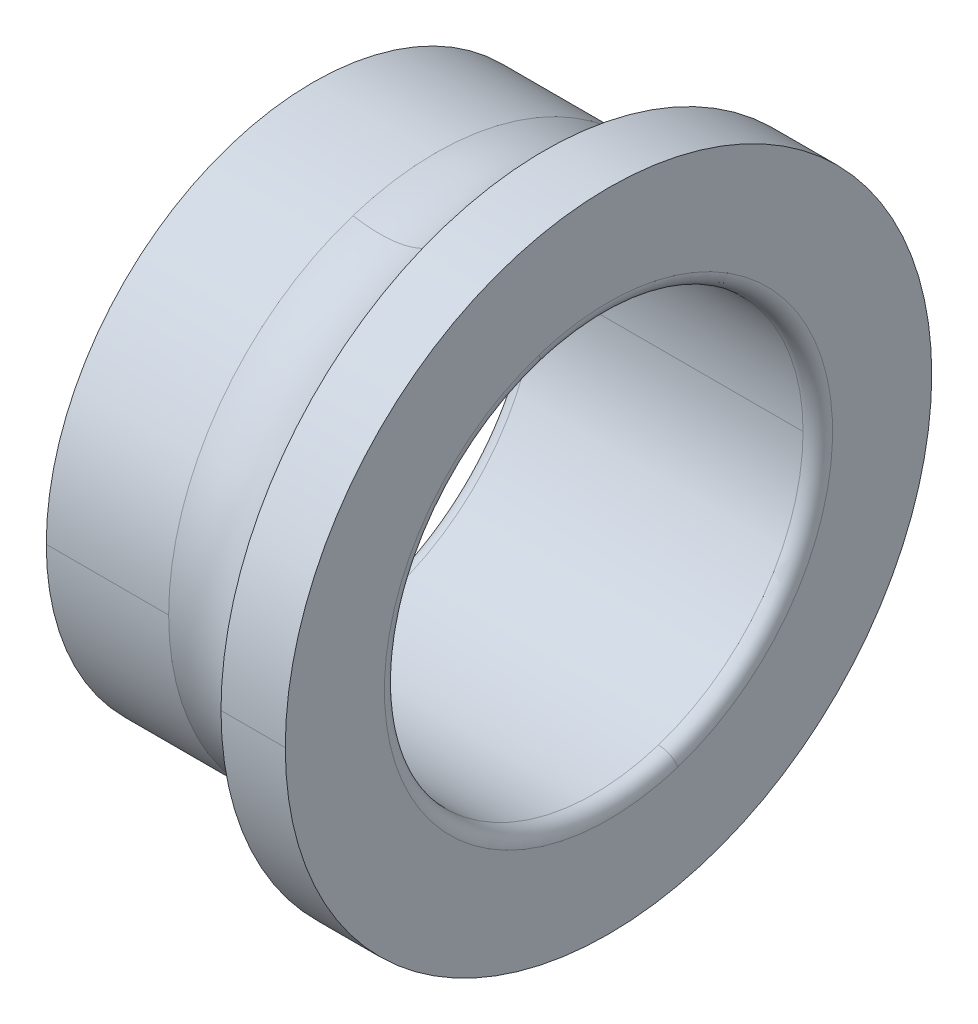
ISO-10303-21;
HEADER;
FILE_DESCRIPTION(('STEP AP214'),'2;1');
FILE_NAME('part.step','',(''),(''),'','','');
FILE_SCHEMA(('AUTOMOTIVE_DESIGN { 1 0 10303 214 1 1 1 1 }'));
ENDSEC;
DATA;
#1=APPLICATION_CONTEXT('core data for automotive mechanical design processes');
#2=APPLICATION_PROTOCOL_DEFINITION('international standard','automotive_design',2000,#1);
#3=PRODUCT_CONTEXT('',#1,'mechanical');
#4=PRODUCT('Part','Part','',(#3));
#5=PRODUCT_RELATED_PRODUCT_CATEGORY('part','',(#4));
#6=PRODUCT_DEFINITION_FORMATION('','',#4);
#7=PRODUCT_DEFINITION_CONTEXT('part definition',#1,'design');
#8=PRODUCT_DEFINITION('design','',#6,#7);
#9=PRODUCT_DEFINITION_SHAPE('','',#8);
#10=(LENGTH_UNIT() NAMED_UNIT(*) SI_UNIT(.MILLI.,.METRE.));
#11=(NAMED_UNIT(*) PLANE_ANGLE_UNIT() SI_UNIT($,.RADIAN.));
#12=(NAMED_UNIT(*) SI_UNIT($,.STERADIAN.) SOLID_ANGLE_UNIT());
#13=UNCERTAINTY_MEASURE_WITH_UNIT(LENGTH_MEASURE(1.E-05),#10,'distance_accuracy_value','');
#14=(GEOMETRIC_REPRESENTATION_CONTEXT(3) GLOBAL_UNCERTAINTY_ASSIGNED_CONTEXT((#13)) GLOBAL_UNIT_ASSIGNED_CONTEXT((#10,
#11,#12)) REPRESENTATION_CONTEXT('',''));
#15=CARTESIAN_POINT('',(0.,0.,0.));
#16=DIRECTION('',(0.,0.,1.));
#17=DIRECTION('',(1.,0.,0.));
#18=AXIS2_PLACEMENT_3D('',#15,#16,#17);
#19=CARTESIAN_POINT('',(12.,0.,0.));
#20=DIRECTION('',(1.,0.,0.));
#21=DIRECTION('',(0.,1.,0.));
#22=AXIS2_PLACEMENT_3D('',#19,#20,#21);
#23=CYLINDRICAL_SURFACE('',#22,10.83);
#24=DIRECTION('',(1.,0.,0.));
#25=VECTOR('',#24,1.);
#26=CARTESIAN_POINT('',(0.,0.,10.83));
#27=LINE('',#26,#25);
#28=CARTESIAN_POINT('',(0.,0.,10.83));
#29=VERTEX_POINT('',#28);
#30=CARTESIAN_POINT('',(4.969085842565,0.,10.83));
#31=VERTEX_POINT('',#30);
#32=EDGE_CURVE('E10',#29,#31,#27,.T.);
#33=ORIENTED_EDGE('',*,*,#32,.F.);
#34=CARTESIAN_POINT('',(0.,0.,0.));
#35=DIRECTION('',(1.,0.,0.));
#36=DIRECTION('',(0.,0.,-1.));
#37=AXIS2_PLACEMENT_3D('',#34,#35,#36);
#38=CIRCLE('',#37,10.83);
#39=CARTESIAN_POINT('',(0.,0.,-10.83));
#40=VERTEX_POINT('',#39);
#41=EDGE_CURVE('E24',#29,#40,#38,.T.);
#42=ORIENTED_EDGE('',*,*,#41,.T.);
#43=DIRECTION('',(1.,0.,0.));
#44=VECTOR('',#43,1.);
#45=CARTESIAN_POINT('',(0.,0.,-10.83));
#46=LINE('',#45,#44);
#47=CARTESIAN_POINT('',(4.969085842565,0.,-10.83));
#48=VERTEX_POINT('',#47);
#49=EDGE_CURVE('E325',#40,#48,#46,.T.);
#50=ORIENTED_EDGE('',*,*,#49,.T.);
#51=CARTESIAN_POINT('',(4.969085842565,0.,0.));
#52=DIRECTION('',(1.,0.,0.));
#53=DIRECTION('',(0.,0.,-1.));
#54=AXIS2_PLACEMENT_3D('',#51,#52,#53);
#55=CIRCLE('',#54,10.83);
#56=CARTESIAN_POINT('',(4.96908584256501,-10.2999420714765,-3.34665404908068));
#57=VERTEX_POINT('',#56);
#58=EDGE_CURVE('E320',#57,#48,#55,.T.);
#59=ORIENTED_EDGE('',*,*,#58,.F.);
#60=CARTESIAN_POINT('',(4.969085842565,0.,0.));
#61=DIRECTION('',(1.,0.,0.));
#62=DIRECTION('',(0.,0.,-1.));
#63=AXIS2_PLACEMENT_3D('',#60,#61,#62);
#64=CIRCLE('',#63,10.83);
#65=EDGE_CURVE('E315',#31,#57,#64,.T.);
#66=ORIENTED_EDGE('',*,*,#65,.F.);
#67=EDGE_LOOP('',(#33,#42,#50,#59,#66));
#68=FACE_BOUND('',#67,.T.);
#69=ADVANCED_FACE('F16',(#68),#23,.T.);
#70=CARTESIAN_POINT('',(5.99999999999977,0.,0.));
#71=DIRECTION('',(1.,0.,0.));
#72=DIRECTION('',(0.,0.309016994374947,-0.951056516295154));
#73=AXIS2_PLACEMENT_3D('',#70,#71,#72);
#74=TOROIDAL_SURFACE('',#73,14.2500000000004,3.57200000000031);
#75=CARTESIAN_POINT('',(5.99999999999977,-13.5525553572063,-4.40349216984313));
#76=DIRECTION('',(0.,0.309016994374947,-0.951056516295154));
#77=DIRECTION('',(-0.288609786515865,0.910586026240071,0.295867335039853));
#78=AXIS2_PLACEMENT_3D('',#75,#76,#77);
#79=CIRCLE('',#78,3.57200000000031);
#80=CARTESIAN_POINT('',(9.3902151849108,-12.4826167763739,-4.05584805117118));
#81=VERTEX_POINT('',#80);
#82=EDGE_CURVE('E311',#57,#81,#79,.T.);
#83=ORIENTED_EDGE('',*,*,#82,.T.);
#84=CARTESIAN_POINT('',(9.3902151849108,0.,0.));
#85=DIRECTION('',(1.,0.,0.));
#86=DIRECTION('',(0.,0.,-1.));
#87=AXIS2_PLACEMENT_3D('',#84,#85,#86);
#88=CIRCLE('',#87,13.125);
#89=CARTESIAN_POINT('',(9.3902151849108,0.,13.125));
#90=VERTEX_POINT('',#89);
#91=EDGE_CURVE('E109',#90,#81,#88,.T.);
#92=ORIENTED_EDGE('',*,*,#91,.F.);
#93=CARTESIAN_POINT('',(9.3902151849108,0.,0.));
#94=DIRECTION('',(1.,0.,0.));
#95=DIRECTION('',(0.,0.,-1.));
#96=AXIS2_PLACEMENT_3D('',#93,#94,#95);
#97=CIRCLE('',#96,13.125);
#98=CARTESIAN_POINT('',(9.3902151849108,12.4826167763739,4.05584805117119));
#99=VERTEX_POINT('',#98);
#100=EDGE_CURVE('E304',#99,#90,#97,.T.);
#101=ORIENTED_EDGE('',*,*,#100,.F.);
#102=CARTESIAN_POINT('',(5.99999999999977,13.5525553572063,4.40349216984313));
#103=DIRECTION('',(0.,-0.309016994374947,0.951056516295154));
#104=DIRECTION('',(-0.288609786515866,-0.91058602624007,-0.295867335039853));
#105=AXIS2_PLACEMENT_3D('',#102,#103,#104);
#106=CIRCLE('',#105,3.57200000000031);
#107=CARTESIAN_POINT('',(4.96908584256501,10.2999420714765,3.34665404908068));
#108=VERTEX_POINT('',#107);
#109=EDGE_CURVE('E119',#108,#99,#106,.T.);
#110=ORIENTED_EDGE('',*,*,#109,.F.);
#111=CARTESIAN_POINT('',(4.969085842565,0.,0.));
#112=DIRECTION('',(1.,0.,0.));
#113=DIRECTION('',(0.,0.,-1.));
#114=AXIS2_PLACEMENT_3D('',#111,#112,#113);
#115=CIRCLE('',#114,10.83);
#116=EDGE_CURVE('E296',#108,#31,#115,.T.);
#117=ORIENTED_EDGE('',*,*,#116,.T.);
#118=ORIENTED_EDGE('',*,*,#65,.T.);
#119=EDGE_LOOP('',(#83,#92,#101,#110,#117,#118));
#120=FACE_BOUND('',#119,.T.);
#121=ADVANCED_FACE('F338',(#120),#74,.F.);
#122=CARTESIAN_POINT('',(12.,0.,0.));
#123=DIRECTION('',(1.,0.,0.));
#124=DIRECTION('',(0.,-1.,0.));
#125=AXIS2_PLACEMENT_3D('',#122,#123,#124);
#126=CYLINDRICAL_SURFACE('',#125,10.83);
#127=ORIENTED_EDGE('',*,*,#32,.T.);
#128=ORIENTED_EDGE('',*,*,#116,.F.);
#129=CARTESIAN_POINT('',(4.969085842565,0.,0.));
#130=DIRECTION('',(1.,0.,0.));
#131=DIRECTION('',(0.,0.,-1.));
#132=AXIS2_PLACEMENT_3D('',#129,#130,#131);
#133=CIRCLE('',#132,10.83);
#134=EDGE_CURVE('E292',#48,#108,#133,.T.);
#135=ORIENTED_EDGE('',*,*,#134,.F.);
#136=ORIENTED_EDGE('',*,*,#49,.F.);
#137=CARTESIAN_POINT('',(0.,0.,0.));
#138=DIRECTION('',(1.,0.,0.));
#139=DIRECTION('',(0.,0.,-1.));
#140=AXIS2_PLACEMENT_3D('',#137,#138,#139);
#141=CIRCLE('',#140,10.83);
#142=EDGE_CURVE('E288',#40,#29,#141,.T.);
#143=ORIENTED_EDGE('',*,*,#142,.T.);
#144=EDGE_LOOP('',(#127,#128,#135,#136,#143));
#145=FACE_BOUND('',#144,.T.);
#146=ADVANCED_FACE('F269',(#145),#126,.T.);
#147=CARTESIAN_POINT('',(0.,10.83,0.));
#148=DIRECTION('',(-1.,0.,0.));
#149=DIRECTION('',(0.,0.,1.));
#150=AXIS2_PLACEMENT_3D('',#147,#148,#149);
#151=PLANE('',#150);
#152=CARTESIAN_POINT('',(0.,0.,0.));
#153=DIRECTION('',(1.,0.,0.));
#154=DIRECTION('',(0.,0.,-1.));
#155=AXIS2_PLACEMENT_3D('',#152,#153,#154);
#156=CIRCLE('',#155,9.1);
#157=CARTESIAN_POINT('',(0.,8.6546142982859,2.81205464881202));
#158=VERTEX_POINT('',#157);
#159=CARTESIAN_POINT('',(0.,-8.6546142982859,-2.81205464881202));
#160=VERTEX_POINT('',#159);
#161=EDGE_CURVE('E286',#158,#160,#156,.T.);
#162=ORIENTED_EDGE('',*,*,#161,.T.);
#163=CARTESIAN_POINT('',(0.,-8.6546142982859,-2.81205464881202));
#164=CARTESIAN_POINT('',(0.,-7.77035322156963,-5.52977285694612));
#165=CARTESIAN_POINT('',(0.,-5.82361355448477,-7.90801404603314));
#166=CARTESIAN_POINT('',(0.,-2.97302640379702,-9.35676213057699));
#167=CARTESIAN_POINT('',(0.,3.15812466204302,-9.71970828071693));
#168=CARTESIAN_POINT('',(0.,7.90499567495906,-5.82227850113272));
#169=CARTESIAN_POINT('',(0.,9.35961636543055,-2.97468359261989));
#170=CARTESIAN_POINT('',(0.,9.53666674238609,0.0936188124392139));
#171=CARTESIAN_POINT('',(0.,8.6546142982859,2.81205464881202));
#172=B_SPLINE_CURVE_WITH_KNOTS('',5,(#163,#164,#165,#166,#167,#168,#169,#170,#171),
.UNSPECIFIED.,.F.,.F.,(6,3,6),(0.,1.5707963267949,3.14159265358979),.UNSPECIFIED.);
#173=EDGE_CURVE('E284',#160,#158,#172,.T.);
#174=ORIENTED_EDGE('',*,*,#173,.T.);
#175=EDGE_LOOP('',(#162,#174));
#176=FACE_BOUND('',#175,.T.);
#177=ORIENTED_EDGE('',*,*,#41,.F.);
#178=ORIENTED_EDGE('',*,*,#142,.F.);
#179=EDGE_LOOP('',(#177,#178));
#180=FACE_BOUND('',#179,.T.);
#181=ADVANCED_FACE('F263',(#176,#180),#151,.T.);
#182=CARTESIAN_POINT('',(0.600000000000048,0.,0.));
#183=DIRECTION('',(1.,0.,0.));
#184=DIRECTION('',(0.,-0.309016994374947,0.951056516295154));
#185=AXIS2_PLACEMENT_3D('',#182,#183,#184);
#186=TOROIDAL_SURFACE('',#185,9.1,0.600000000000048);
#187=CARTESIAN_POINT('',(0.600000000000048,-8.6546142982859,-2.81205464881202));
#188=DIRECTION('',(0.,0.309016994374947,-0.951056516295154));
#189=DIRECTION('',(-1.,0.,0.));
#190=AXIS2_PLACEMENT_3D('',#187,#188,#189);
#191=CIRCLE('',#190,0.600000000000048);
#192=CARTESIAN_POINT('',(0.600000000000001,-8.08398038850876,-2.62664445218704));
#193=VERTEX_POINT('',#192);
#194=EDGE_CURVE('E493',#160,#193,#191,.T.);
#195=ORIENTED_EDGE('',*,*,#194,.T.);
#196=CARTESIAN_POINT('',(0.6,0.,0.));
#197=DIRECTION('',(1.,0.,0.));
#198=DIRECTION('',(0.,0.,-1.));
#199=AXIS2_PLACEMENT_3D('',#196,#197,#198);
#200=CIRCLE('',#199,8.5);
#201=CARTESIAN_POINT('',(0.6,0.,-8.5));
#202=VERTEX_POINT('',#201);
#203=EDGE_CURVE('E491',#193,#202,#200,.T.);
#204=ORIENTED_EDGE('',*,*,#203,.T.);
#205=CARTESIAN_POINT('',(0.6,0.,0.));
#206=DIRECTION('',(1.,0.,0.));
#207=DIRECTION('',(0.,0.,-1.));
#208=AXIS2_PLACEMENT_3D('',#205,#206,#207);
#209=CIRCLE('',#208,8.5);
#210=CARTESIAN_POINT('',(0.6,8.08398038850876,2.62664445218704));
#211=VERTEX_POINT('',#210);
#212=EDGE_CURVE('E489',#202,#211,#209,.T.);
#213=ORIENTED_EDGE('',*,*,#212,.T.);
#214=CARTESIAN_POINT('',(0.600000000000048,8.6546142982859,2.81205464881202));
#215=DIRECTION('',(0.,-0.309016994374947,0.951056516295154));
#216=DIRECTION('',(-1.,0.,0.));
#217=AXIS2_PLACEMENT_3D('',#214,#215,#216);
#218=CIRCLE('',#217,0.600000000000048);
#219=EDGE_CURVE('E243',#158,#211,#218,.T.);
#220=ORIENTED_EDGE('',*,*,#219,.F.);
#221=ORIENTED_EDGE('',*,*,#173,.F.);
#222=EDGE_LOOP('',(#195,#204,#213,#220,#221));
#223=FACE_BOUND('',#222,.T.);
#224=ADVANCED_FACE('F252',(#223),#186,.T.);
#225=CARTESIAN_POINT('',(0.600000000000048,0.,0.));
#226=DIRECTION('',(1.,0.,0.));
#227=DIRECTION('',(0.,0.309016994374947,-0.951056516295154));
#228=AXIS2_PLACEMENT_3D('',#225,#226,#227);
#229=TOROIDAL_SURFACE('',#228,9.1,0.600000000000048);
#230=ORIENTED_EDGE('',*,*,#194,.F.);
#231=ORIENTED_EDGE('',*,*,#161,.F.);
#232=ORIENTED_EDGE('',*,*,#219,.T.);
#233=CARTESIAN_POINT('',(0.6,0.,0.));
#234=DIRECTION('',(1.,0.,0.));
#235=DIRECTION('',(0.,0.,-1.));
#236=AXIS2_PLACEMENT_3D('',#233,#234,#235);
#237=CIRCLE('',#236,8.5);
#238=CARTESIAN_POINT('',(0.6,0.,8.5));
#239=VERTEX_POINT('',#238);
#240=EDGE_CURVE('E239',#211,#239,#237,.T.);
#241=ORIENTED_EDGE('',*,*,#240,.T.);
#242=CARTESIAN_POINT('',(0.6,0.,0.));
#243=DIRECTION('',(1.,0.,0.));
#244=DIRECTION('',(0.,0.,-1.));
#245=AXIS2_PLACEMENT_3D('',#242,#243,#244);
#246=CIRCLE('',#245,8.5);
#247=EDGE_CURVE('E234',#239,#193,#246,.T.);
#248=ORIENTED_EDGE('',*,*,#247,.T.);
#249=EDGE_LOOP('',(#230,#231,#232,#241,#248));
#250=FACE_BOUND('',#249,.T.);
#251=ADVANCED_FACE('F262',(#250),#229,.T.);
#252=CARTESIAN_POINT('',(12.,0.,0.));
#253=DIRECTION('',(1.,0.,0.));
#254=DIRECTION('',(0.,1.,0.));
#255=AXIS2_PLACEMENT_3D('',#252,#253,#254);
#256=CYLINDRICAL_SURFACE('',#255,8.5);
#257=DIRECTION('',(1.,0.,0.));
#258=VECTOR('',#257,1.);
#259=CARTESIAN_POINT('',(0.6,0.,8.5));
#260=LINE('',#259,#258);
#261=CARTESIAN_POINT('',(11.4,0.,8.5));
#262=VERTEX_POINT('',#261);
#263=EDGE_CURVE('E230',#239,#262,#260,.T.);
#264=ORIENTED_EDGE('',*,*,#263,.T.);
#265=CARTESIAN_POINT('',(11.4,0.,0.));
#266=DIRECTION('',(1.,0.,0.));
#267=DIRECTION('',(0.,0.,-1.));
#268=AXIS2_PLACEMENT_3D('',#265,#266,#267);
#269=CIRCLE('',#268,8.5);
#270=CARTESIAN_POINT('',(11.4,-8.08398038850888,-2.62664445218707));
#271=VERTEX_POINT('',#270);
#272=EDGE_CURVE('E226',#262,#271,#269,.T.);
#273=ORIENTED_EDGE('',*,*,#272,.T.);
#274=CARTESIAN_POINT('',(11.4,0.,0.));
#275=DIRECTION('',(1.,0.,0.));
#276=DIRECTION('',(0.,0.,-1.));
#277=AXIS2_PLACEMENT_3D('',#274,#275,#276);
#278=CIRCLE('',#277,8.5);
#279=CARTESIAN_POINT('',(11.4,0.,-8.5));
#280=VERTEX_POINT('',#279);
#281=EDGE_CURVE('E222',#271,#280,#278,.T.);
#282=ORIENTED_EDGE('',*,*,#281,.T.);
#283=DIRECTION('',(1.,0.,0.));
#284=VECTOR('',#283,1.);
#285=CARTESIAN_POINT('',(0.6,0.,-8.5));
#286=LINE('',#285,#284);
#287=EDGE_CURVE('E217',#202,#280,#286,.T.);
#288=ORIENTED_EDGE('',*,*,#287,.F.);
#289=ORIENTED_EDGE('',*,*,#203,.F.);
#290=ORIENTED_EDGE('',*,*,#247,.F.);
#291=EDGE_LOOP('',(#264,#273,#282,#288,#289,#290));
#292=FACE_BOUND('',#291,.T.);
#293=ADVANCED_FACE('F389',(#292),#256,.F.);
#294=CARTESIAN_POINT('',(12.,0.,0.));
#295=DIRECTION('',(1.,0.,0.));
#296=DIRECTION('',(0.,-1.,0.));
#297=AXIS2_PLACEMENT_3D('',#294,#295,#296);
#298=CYLINDRICAL_SURFACE('',#297,8.5);
#299=ORIENTED_EDGE('',*,*,#263,.F.);
#300=ORIENTED_EDGE('',*,*,#240,.F.);
#301=ORIENTED_EDGE('',*,*,#212,.F.);
#302=ORIENTED_EDGE('',*,*,#287,.T.);
#303=CARTESIAN_POINT('',(11.4,0.,0.));
#304=DIRECTION('',(1.,0.,0.));
#305=DIRECTION('',(0.,0.,-1.));
#306=AXIS2_PLACEMENT_3D('',#303,#304,#305);
#307=CIRCLE('',#306,8.5);
#308=CARTESIAN_POINT('',(11.4,8.08398038850888,2.62664445218708));
#309=VERTEX_POINT('',#308);
#310=EDGE_CURVE('E213',#280,#309,#307,.T.);
#311=ORIENTED_EDGE('',*,*,#310,.T.);
#312=CARTESIAN_POINT('',(11.4,0.,0.));
#313=DIRECTION('',(1.,0.,0.));
#314=DIRECTION('',(0.,0.,-1.));
#315=AXIS2_PLACEMENT_3D('',#312,#313,#314);
#316=CIRCLE('',#315,8.5);
#317=EDGE_CURVE('E208',#309,#262,#316,.T.);
#318=ORIENTED_EDGE('',*,*,#317,.T.);
#319=EDGE_LOOP('',(#299,#300,#301,#302,#311,#318));
#320=FACE_BOUND('',#319,.T.);
#321=ADVANCED_FACE('F399',(#320),#298,.F.);
#322=CARTESIAN_POINT('',(11.4,0.,0.));
#323=DIRECTION('',(1.,0.,0.));
#324=DIRECTION('',(0.,0.309016994374947,-0.951056516295154));
#325=AXIS2_PLACEMENT_3D('',#322,#323,#324);
#326=TOROIDAL_SURFACE('',#325,9.1,0.599999999999927);
#327=CARTESIAN_POINT('',(11.4,-8.6546142982859,-2.81205464881202));
#328=DIRECTION('',(0.,0.309016994374947,-0.951056516295154));
#329=DIRECTION('',(0.,0.951056516295154,0.309016994374947));
#330=AXIS2_PLACEMENT_3D('',#327,#328,#329);
#331=CIRCLE('',#330,0.599999999999927);
#332=CARTESIAN_POINT('',(11.9999999999999,-8.6546142982859,-2.81205464881202));
#333=VERTEX_POINT('',#332);
#334=EDGE_CURVE('E187',#271,#333,#331,.T.);
#335=ORIENTED_EDGE('',*,*,#334,.F.);
#336=ORIENTED_EDGE('',*,*,#272,.F.);
#337=ORIENTED_EDGE('',*,*,#317,.F.);
#338=CARTESIAN_POINT('',(11.4,8.6546142982859,2.81205464881202));
#339=DIRECTION('',(0.,-0.309016994374947,0.951056516295154));
#340=DIRECTION('',(0.,-0.951056516295154,-0.309016994374947));
#341=AXIS2_PLACEMENT_3D('',#338,#339,#340);
#342=CIRCLE('',#341,0.599999999999927);
#343=CARTESIAN_POINT('',(11.9999999999999,8.6546142982859,2.81205464881202));
#344=VERTEX_POINT('',#343);
#345=EDGE_CURVE('E186',#309,#344,#342,.T.);
#346=ORIENTED_EDGE('',*,*,#345,.T.);
#347=CARTESIAN_POINT('',(11.9999999999999,8.65461429828589,2.81205464881204));
#348=CARTESIAN_POINT('',(11.9999999999999,8.60860511914574,2.95366656315673));
#349=CARTESIAN_POINT('',(11.9999999999999,8.55911447032686,3.09414699684201));
#350=CARTESIAN_POINT('',(11.9999999999999,8.45330243894805,3.37251140646159));
#351=CARTESIAN_POINT('',(11.9999999999999,8.39698105638814,3.51039538239588));
#352=CARTESIAN_POINT('',(11.9999999999999,8.27763976314372,3.78323338008131));
#353=CARTESIAN_POINT('',(11.9999999999999,8.21461985245923,3.91818740183245));
#354=CARTESIAN_POINT('',(11.9999999999999,8.08203425525104,4.1848407292831));
#355=CARTESIAN_POINT('',(11.9999999999999,8.01246856872733,4.3165400349826));
#356=CARTESIAN_POINT('',(11.9999999999999,7.86695875999756,4.576366560262));
#357=CARTESIAN_POINT('',(11.9999999999999,7.79101463779149,4.70449377984189));
#358=CARTESIAN_POINT('',(11.9999999999999,7.63293098063957,4.9568674886172));
#359=CARTESIAN_POINT('',(11.9999999999999,7.55079144569371,5.08111397781262));
#360=CARTESIAN_POINT('',(11.9999999999999,7.38051482647062,5.32542689832994));
#361=CARTESIAN_POINT('',(11.9999999999999,7.29237774219337,5.44549332965184));
#362=CARTESIAN_POINT('',(11.9999999999999,7.11031835906663,5.68115688569824));
#363=CARTESIAN_POINT('',(11.9999999999999,7.01639606021713,5.79675401042276));
#364=CARTESIAN_POINT('',(11.9999999999999,6.82299251370341,6.02320046918661));
#365=CARTESIAN_POINT('',(11.9999999999999,6.7235112660392,6.13404980322595));
#366=CARTESIAN_POINT('',(11.9999999999999,6.51922948128005,6.35073363499558));
#367=CARTESIAN_POINT('',(11.9999999999999,6.41442894418512,6.45656813272588));
#368=CARTESIAN_POINT('',(11.9999999999999,6.19976105414544,6.66296732726726));
#369=CARTESIAN_POINT('',(11.9999999999999,6.08989370120069,6.76353202407835));
#370=CARTESIAN_POINT('',(11.9999999999999,5.86535685956264,6.95914934762769));
#371=CARTESIAN_POINT('',(11.9999999999999,5.75068737086933,7.05420197436594));
#372=CARTESIAN_POINT('',(11.9999999999999,5.51682250656963,7.23856616766363));
#373=CARTESIAN_POINT('',(11.9999999999999,5.39762713096324,7.32787773422308));
#374=CARTESIAN_POINT('',(11.9999999999999,5.15499764493929,7.50054464777724));
#375=CARTESIAN_POINT('',(11.9999999999999,5.03156353452172,7.58389999477195));
#376=CARTESIAN_POINT('',(11.9999999999999,4.78075394245847,7.74445365886448));
#377=CARTESIAN_POINT('',(11.9999999999999,4.65337846081279,7.82165197596229));
#378=CARTESIAN_POINT('',(11.9999999999999,4.3949929849855,7.96970560275342));
#379=CARTESIAN_POINT('',(11.9999999999999,4.2639829908039,8.04056091244673));
#380=CARTESIAN_POINT('',(11.9999999999999,3.99864410445583,8.17575782778158));
#381=CARTESIAN_POINT('',(11.9999999999999,3.86431521228938,8.24009943342312));
#382=CARTESIAN_POINT('',(11.9999999999999,3.59266214003866,8.3621139360908));
#383=CARTESIAN_POINT('',(11.9999999999999,3.45533795995441,8.41978683311693));
#384=CARTESIAN_POINT('',(11.9999999999999,3.1780251378461,8.5283249794933));
#385=CARTESIAN_POINT('',(11.9999999999999,3.03803649582205,8.57919022884354));
#386=CARTESIAN_POINT('',(11.9999999999999,2.75573199473434,8.67399054102716));
#387=CARTESIAN_POINT('',(11.9999999999999,2.61341613567068,8.71792560386054));
#388=CARTESIAN_POINT('',(11.9999999999999,2.32680005187365,8.79875969959584));
#389=CARTESIAN_POINT('',(11.9999999999999,2.18249982714027,8.83565873249775));
#390=CARTESIAN_POINT('',(11.9999999999999,1.89226264388438,8.90233187536787));
#391=CARTESIAN_POINT('',(11.9999999999999,1.74632568536187,8.93210598533607));
#392=CARTESIAN_POINT('',(11.9999999999999,1.45316660944336,8.98445755389996));
#393=CARTESIAN_POINT('',(11.9999999999999,1.30594449204736,9.00703501249564));
#394=CARTESIAN_POINT('',(11.9999999999999,1.01056976935783,9.04493888723916));
#395=CARTESIAN_POINT('',(11.9999999999999,0.862417164064294,9.060265303387));
#396=CARTESIAN_POINT('',(11.9999999999999,0.565538378182463,9.08363017055592));
#397=CARTESIAN_POINT('',(11.9999999999999,0.41681219759417,9.091668621577));
#398=CARTESIAN_POINT('',(11.9999999999999,0.119144555518741,9.10043819315979));
#399=CARTESIAN_POINT('',(11.9999999999999,-0.0297969059683946,9.1011693137215));
#400=CARTESIAN_POINT('',(11.9999999999999,-0.327536296815056,9.09532246305208));
#401=CARTESIAN_POINT('',(11.9999999999999,-0.476334226174581,9.08874449182095));
#402=CARTESIAN_POINT('',(11.9999999999999,-0.773428085521034,9.06829530447473));
#403=CARTESIAN_POINT('',(11.9999999999999,-0.921724015507962,9.05442408835962));
#404=CARTESIAN_POINT('',(11.9999999999999,-1.21745661822469,9.01942182822004));
#405=CARTESIAN_POINT('',(11.9999999999999,-1.3648932909545,8.99829078419555));
#406=CARTESIAN_POINT('',(11.9999999999999,-1.65855219129844,8.94881977477311));
#407=CARTESIAN_POINT('',(11.9999999999999,-1.80477441891259,8.92047980937516));
#408=CARTESIAN_POINT('',(11.9999999999999,-2.09565216687134,8.85665923066472));
#409=CARTESIAN_POINT('',(11.9999999999999,-2.24030768721596,8.82117861735223));
#410=CARTESIAN_POINT('',(11.9999999999999,-2.5277035328168,8.74316221871793));
#411=CARTESIAN_POINT('',(11.9999999999999,-2.67044385807303,8.70062643339611));
#412=CARTESIAN_POINT('',(11.9999999999999,-2.95366543955102,8.60860216317568));
#413=CARTESIAN_POINT('',(11.9999999999999,-3.09414669577276,8.55911367827707));
#414=CARTESIAN_POINT('',(11.9999999999999,-3.37251170753082,8.45330323099785));
#415=CARTESIAN_POINT('',(11.9999999999999,-3.51039546306713,8.39698126861724));
#416=CARTESIAN_POINT('',(11.9999999999999,-3.78323329941004,8.27763955091463));
#417=CARTESIAN_POINT('',(11.9999999999999,-3.91818738021664,8.21461979559262));
#418=CARTESIAN_POINT('',(11.9999999999999,-4.18484075089888,8.08203431211766));
#419=CARTESIAN_POINT('',(11.9999999999999,-4.31654004077453,8.01246858396471));
#420=CARTESIAN_POINT('',(11.9999999999999,-4.57636655447005,7.8669587447602));
#421=CARTESIAN_POINT('',(11.9999999999999,-4.70449377828993,7.79101463370866));
#422=CARTESIAN_POINT('',(11.9999999999999,-4.95686749016913,7.63293098472241));
#423=CARTESIAN_POINT('',(11.9999999999999,-5.08111397822846,7.55079144678772));
#424=CARTESIAN_POINT('',(11.9999999999999,-5.32542689791409,7.38051482537663));
#425=CARTESIAN_POINT('',(11.9999999999999,-5.4454933295404,7.29237774190024));
#426=CARTESIAN_POINT('',(11.9999999999999,-5.68115688580966,7.11031835935977));
#427=CARTESIAN_POINT('',(11.9999999999999,-5.7967540104526,7.01639606029568));
#428=CARTESIAN_POINT('',(11.9999999999999,-6.02320046915674,6.82299251362488));
#429=CARTESIAN_POINT('',(11.9999999999999,-6.13404980321794,6.72351126601816));
#430=CARTESIAN_POINT('',(11.9999999999999,-6.35073363500357,6.5192294813011));
#431=CARTESIAN_POINT('',(11.9999999999999,-6.45656813272801,6.41442894419076));
#432=CARTESIAN_POINT('',(11.9999999999999,-6.66296732726511,6.19976105413981));
#433=CARTESIAN_POINT('',(11.9999999999999,-6.76353202407777,6.08989370119919));
#434=CARTESIAN_POINT('',(11.9999999999999,-6.95914934762826,5.86535685956416));
#435=CARTESIAN_POINT('',(11.9999999999999,-7.05420197436608,5.75068737086975));
#436=CARTESIAN_POINT('',(11.9999999999999,-7.23856616766347,5.51682250656924));
#437=CARTESIAN_POINT('',(11.9999999999999,-7.32787773422303,5.39762713096315));
#438=CARTESIAN_POINT('',(11.9999999999999,-7.50054464777727,5.15499764493941));
#439=CARTESIAN_POINT('',(11.9999999999999,-7.58389999477195,5.03156353452176));
#440=CARTESIAN_POINT('',(11.9999999999999,-7.74445365886446,4.78075394245845));
#441=CARTESIAN_POINT('',(11.9999999999999,-7.82165197596228,4.65337846081279));
#442=CARTESIAN_POINT('',(11.9999999999999,-7.96970560275342,4.39499298498552));
#443=CARTESIAN_POINT('',(11.9999999999999,-8.04056091244673,4.26398299080391));
#444=CARTESIAN_POINT('',(11.9999999999999,-8.17575782778157,3.99864410445584));
#445=CARTESIAN_POINT('',(11.9999999999999,-8.24009943342311,3.86431521228939));
#446=CARTESIAN_POINT('',(11.9999999999999,-8.3621139360908,3.59266214003867));
#447=CARTESIAN_POINT('',(11.9999999999999,-8.41978683311696,3.45533795995441));
#448=CARTESIAN_POINT('',(11.9999999999999,-8.52832497949327,3.17802513784612));
#449=CARTESIAN_POINT('',(11.9999999999999,-8.57919022884342,3.03803649582209));
#450=CARTESIAN_POINT('',(11.9999999999999,-8.67399054102727,2.75573199473432));
#451=CARTESIAN_POINT('',(11.9999999999999,-8.71792560386096,2.61341613567058));
#452=CARTESIAN_POINT('',(11.9999999999999,-8.79875969959542,2.32680005187377));
#453=CARTESIAN_POINT('',(11.9999999999999,-8.83565873249619,2.1824998271407));
#454=CARTESIAN_POINT('',(11.9999999999999,-8.90233187536943,1.89226264388397));
#455=CARTESIAN_POINT('',(11.9999999999999,-8.9321059853419,1.7463256853603));
#456=CARTESIAN_POINT('',(11.9999999999999,-8.98445755389413,1.45316660944496));
#457=CARTESIAN_POINT('',(11.9999999999999,-9.00703501247391,1.30594449205328));
#458=CARTESIAN_POINT('',(11.9999999999999,-9.04493888726089,1.01056976935195));
#459=CARTESIAN_POINT('',(11.9999999999999,-9.0602653034681,0.862417164042297));
#460=CARTESIAN_POINT('',(11.9999999999999,-9.08363017047483,0.565538378204493));
#461=CARTESIAN_POINT('',(11.9999999999999,-9.09166862127435,0.416812197676342));
#462=CARTESIAN_POINT('',(11.9999999999999,-9.10043819346243,0.119144555436602));
#463=CARTESIAN_POINT('',(11.9999999999999,-9.10116931485098,-0.0297969062749878));
#464=CARTESIAN_POINT('',(11.9999999999999,-9.0953224619226,-0.327536296508429));
#465=CARTESIAN_POINT('',(11.9999999999999,-9.08874448760566,-0.476334225030281));
#466=CARTESIAN_POINT('',(11.9999999999999,-9.06829530869003,-0.773428086665303));
#467=CARTESIAN_POINT('',(11.9999999999999,-9.05442410409133,-0.921724019778474));
#468=CARTESIAN_POINT('',(11.9999999999999,-9.01942181248834,-1.21745661395416));
#469=CARTESIAN_POINT('',(11.9999999999999,-8.99829072548404,-1.36489327501668));
#470=CARTESIAN_POINT('',(11.9999999999999,-8.94881983348462,-1.65855220723624));
#471=CARTESIAN_POINT('',(11.9999999999999,-8.92048002848949,-1.80477447839329));
#472=CARTESIAN_POINT('',(11.9999999999999,-8.85665901155039,-2.09565210739062));
#473=CARTESIAN_POINT('',(11.9999999999999,-8.82117779960643,-2.24030746523089));
#474=CARTESIAN_POINT('',(11.9999999999999,-8.74316303646373,-2.52770375480184));
#475=CARTESIAN_POINT('',(11.9999999999999,-8.700629485265,-2.67044468653252));
#476=CARTESIAN_POINT('',(11.9999999999999,-8.6546142982859,-2.81205464881201));
#477=B_SPLINE_CURVE_WITH_KNOTS('',3,(#347,#348,#349,#350,#351,#352,#353,#354,#355,#356,#357,
#358,#359,#360,#361,#362,#363,#364,#365,#366,#367,#368,#369,#370,#371,#372,#373,#374,#375,#376,
#377,#378,#379,#380,#381,#382,#383,#384,#385,#386,#387,#388,#389,#390,#391,#392,#393,#394,#395,
#396,#397,#398,#399,#400,#401,#402,#403,#404,#405,#406,#407,#408,#409,#410,#411,#412,#413,#414,
#415,#416,#417,#418,#419,#420,#421,#422,#423,#424,#425,#426,#427,#428,#429,#430,#431,#432,#433,
#434,#435,#436,#437,#438,#439,#440,#441,#442,#443,#444,#445,#446,#447,#448,#449,#450,#451,#452,
#453,#454,#455,#456,#457,#458,#459,#460,#461,#462,#463,#464,#465,#466,#467,#468,#469,#470,#471,
#472,#473,#474,#475,#476),.UNSPECIFIED.,.F.,.F.,(4,2,2,2,2,2,2,2,2,2,2,2,2,2,2,2,2,2,2,2,2,2,2,
2,2,2,2,2,2,2,2,2,2,2,2,2,2,2,2,2,2,2,2,2,2,2,2,2,2,2,2,2,2,2,2,2,2,2,2,2,2,2,2,2,4),(0.,
0.446650359117002,0.893300718234006,1.33995107735101,1.78660143646801,2.23325179558501,
2.67990215470202,3.12655251381902,3.57320287293603,4.01985323205303,4.46650359117003,
4.91315395028704,5.35980430940404,5.80645466852104,6.25310502763804,6.69975538675505,
7.14640574587205,7.59305610498905,8.03970646410606,8.48635682322306,8.93300718234006,
9.37965754145707,9.82630790057408,10.2729582596911,10.7196086188081,11.1662589779251,
11.6129093370421,12.0595596961591,12.5062100552761,12.9528604143931,13.3995107735101,
13.8461611326271,14.2928114917441,14.7394618508611,15.1861122099781,15.6327625690951,
16.0794129282121,16.5260632873291,16.9727136464461,17.4193640055631,17.8660143646801,
18.3126647237971,18.7593150829141,19.2059654420311,19.6526158011481,20.0992661602651,
20.5459165193821,20.9925668784992,21.4392172376162,21.8858675967332,22.3325179558502,
22.7791683149672,23.2258186740842,23.6724690332012,24.1191193923182,24.5657697514352,
25.0124201105522,25.4590704696692,25.9057208287862,26.3523711879032,26.7990215470202,
27.2456719061372,27.6923222652542,28.1389726243712,28.5856229834882),.UNSPECIFIED.);
#478=EDGE_CURVE('E181',#344,#333,#477,.T.);
#479=ORIENTED_EDGE('',*,*,#478,.T.);
#480=EDGE_LOOP('',(#335,#336,#337,#346,#479));
#481=FACE_BOUND('',#480,.T.);
#482=ADVANCED_FACE('F161',(#481),#326,.T.);
#483=CARTESIAN_POINT('',(12.,9.1,0.));
#484=DIRECTION('',(1.,0.,0.));
#485=DIRECTION('',(0.,0.,-1.));
#486=AXIS2_PLACEMENT_3D('',#483,#484,#485);
#487=PLANE('',#486);
#488=CARTESIAN_POINT('',(12.,0.,0.));
#489=DIRECTION('',(1.,0.,0.));
#490=DIRECTION('',(0.,0.,-1.));
#491=AXIS2_PLACEMENT_3D('',#488,#489,#490);
#492=CIRCLE('',#491,13.125);
#493=CARTESIAN_POINT('',(12.,0.,-13.125));
#494=VERTEX_POINT('',#493);
#495=CARTESIAN_POINT('',(12.,0.,13.125));
#496=VERTEX_POINT('',#495);
#497=EDGE_CURVE('E126',#494,#496,#492,.T.);
#498=ORIENTED_EDGE('',*,*,#497,.T.);
#499=CARTESIAN_POINT('',(12.,0.,0.));
#500=DIRECTION('',(1.,0.,0.));
#501=DIRECTION('',(0.,0.,-1.));
#502=AXIS2_PLACEMENT_3D('',#499,#500,#501);
#503=CIRCLE('',#502,13.125);
#504=EDGE_CURVE('E189',#496,#494,#503,.T.);
#505=ORIENTED_EDGE('',*,*,#504,.T.);
#506=EDGE_LOOP('',(#498,#505));
#507=FACE_BOUND('',#506,.T.);
#508=CARTESIAN_POINT('',(11.9999999999999,-8.65461429828589,-2.81205464881204));
#509=CARTESIAN_POINT('',(11.9999999999999,-8.60860511914574,-2.95366656315673));
#510=CARTESIAN_POINT('',(11.9999999999999,-8.55911447032686,-3.09414699684201));
#511=CARTESIAN_POINT('',(11.9999999999999,-8.45330243894805,-3.37251140646159));
#512=CARTESIAN_POINT('',(11.9999999999999,-8.39698105638814,-3.51039538239588));
#513=CARTESIAN_POINT('',(11.9999999999999,-8.27763976314372,-3.78323338008131));
#514=CARTESIAN_POINT('',(11.9999999999999,-8.21461985245923,-3.91818740183245));
#515=CARTESIAN_POINT('',(11.9999999999999,-8.08203425525104,-4.18484072928309));
#516=CARTESIAN_POINT('',(11.9999999999999,-8.01246856872733,-4.3165400349826));
#517=CARTESIAN_POINT('',(11.9999999999999,-7.86695875999756,-4.576366560262));
#518=CARTESIAN_POINT('',(11.9999999999999,-7.79101463779149,-4.70449377984189));
#519=CARTESIAN_POINT('',(11.9999999999999,-7.63293098063957,-4.9568674886172));
#520=CARTESIAN_POINT('',(11.9999999999999,-7.55079144569372,-5.08111397781262));
#521=CARTESIAN_POINT('',(11.9999999999999,-7.38051482647062,-5.32542689832994));
#522=CARTESIAN_POINT('',(11.9999999999999,-7.29237774219337,-5.44549332965183));
#523=CARTESIAN_POINT('',(11.9999999999999,-7.11031835906663,-5.68115688569824));
#524=CARTESIAN_POINT('',(11.9999999999999,-7.01639606021713,-5.79675401042275));
#525=CARTESIAN_POINT('',(11.9999999999999,-6.82299251370342,-6.0232004691866));
#526=CARTESIAN_POINT('',(11.9999999999999,-6.7235112660392,-6.13404980322594));
#527=CARTESIAN_POINT('',(11.9999999999999,-6.51922948128005,-6.35073363499558));
#528=CARTESIAN_POINT('',(11.9999999999999,-6.41442894418512,-6.45656813272587));
#529=CARTESIAN_POINT('',(11.9999999999999,-6.19976105414544,-6.66296732726726));
#530=CARTESIAN_POINT('',(11.9999999999999,-6.0898937012007,-6.76353202407835));
#531=CARTESIAN_POINT('',(11.9999999999999,-5.86535685956264,-6.95914934762768));
#532=CARTESIAN_POINT('',(11.9999999999999,-5.75068737086933,-7.05420197436593));
#533=CARTESIAN_POINT('',(11.9999999999999,-5.51682250656963,-7.23856616766363));
#534=CARTESIAN_POINT('',(11.9999999999999,-5.39762713096325,-7.32787773422308));
#535=CARTESIAN_POINT('',(11.9999999999999,-5.15499764493929,-7.50054464777724));
#536=CARTESIAN_POINT('',(11.9999999999999,-5.03156353452172,-7.58389999477195));
#537=CARTESIAN_POINT('',(11.9999999999999,-4.78075394245847,-7.74445365886447));
#538=CARTESIAN_POINT('',(11.9999999999999,-4.65337846081279,-7.82165197596229));
#539=CARTESIAN_POINT('',(11.9999999999999,-4.39499298498551,-7.96970560275341));
#540=CARTESIAN_POINT('',(11.9999999999999,-4.2639829908039,-8.04056091244672));
#541=CARTESIAN_POINT('',(11.9999999999999,-3.99864410445584,-8.17575782778157));
#542=CARTESIAN_POINT('',(11.9999999999999,-3.86431521228938,-8.24009943342312));
#543=CARTESIAN_POINT('',(11.9999999999999,-3.59266214003867,-8.3621139360908));
#544=CARTESIAN_POINT('',(11.9999999999999,-3.45533795995441,-8.41978683311693));
#545=CARTESIAN_POINT('',(11.9999999999999,-3.17802513784611,-8.52832497949329));
#546=CARTESIAN_POINT('',(11.9999999999999,-3.03803649582205,-8.57919022884353));
#547=CARTESIAN_POINT('',(11.9999999999999,-2.75573199473435,-8.67399054102716));
#548=CARTESIAN_POINT('',(11.9999999999999,-2.61341613567069,-8.71792560386054));
#549=CARTESIAN_POINT('',(11.9999999999999,-2.32680005187366,-8.79875969959584));
#550=CARTESIAN_POINT('',(11.9999999999999,-2.18249982714028,-8.83565873249775));
#551=CARTESIAN_POINT('',(11.9999999999999,-1.89226264388439,-8.90233187536787));
#552=CARTESIAN_POINT('',(11.9999999999999,-1.74632568536188,-8.93210598533607));
#553=CARTESIAN_POINT('',(11.9999999999999,-1.45316660944338,-8.98445755389995));
#554=CARTESIAN_POINT('',(11.9999999999999,-1.30594449204738,-9.00703501249563));
#555=CARTESIAN_POINT('',(11.9999999999999,-1.01056976935785,-9.04493888723916));
#556=CARTESIAN_POINT('',(11.9999999999999,-0.862417164064308,-9.060265303387));
#557=CARTESIAN_POINT('',(11.9999999999999,-0.565538378182475,-9.08363017055592));
#558=CARTESIAN_POINT('',(11.9999999999999,-0.41681219759418,-9.091668621577));
#559=CARTESIAN_POINT('',(11.9999999999999,-0.119144555518751,-9.10043819315979));
#560=CARTESIAN_POINT('',(11.9999999999999,0.0297969059683832,-9.1011693137215));
#561=CARTESIAN_POINT('',(11.9999999999999,0.327536296815044,-9.09532246305208));
#562=CARTESIAN_POINT('',(11.9999999999999,0.476334226174571,-9.08874449182095));
#563=CARTESIAN_POINT('',(11.9999999999999,0.773428085521023,-9.06829530447473));
#564=CARTESIAN_POINT('',(11.9999999999999,0.92172401550795,-9.05442408835962));
#565=CARTESIAN_POINT('',(11.9999999999999,1.21745661822468,-9.01942182822004));
#566=CARTESIAN_POINT('',(11.9999999999999,1.36489329095448,-8.99829078419555));
#567=CARTESIAN_POINT('',(11.9999999999999,1.65855219129843,-8.94881977477311));
#568=CARTESIAN_POINT('',(11.9999999999999,1.80477441891258,-8.92047980937516));
#569=CARTESIAN_POINT('',(11.9999999999999,2.09565216687133,-8.85665923066472));
#570=CARTESIAN_POINT('',(11.9999999999999,2.24030768721594,-8.82117861735224));
#571=CARTESIAN_POINT('',(11.9999999999999,2.52770353281678,-8.74316221871793));
#572=CARTESIAN_POINT('',(11.9999999999999,2.67044385807302,-8.70062643339612));
#573=CARTESIAN_POINT('',(11.9999999999999,2.953665439551,-8.60860216317569));
#574=CARTESIAN_POINT('',(11.9999999999999,3.09414669577275,-8.55911367827708));
#575=CARTESIAN_POINT('',(11.9999999999999,3.37251170753081,-8.45330323099786));
#576=CARTESIAN_POINT('',(11.9999999999999,3.51039546306712,-8.39698126861725));
#577=CARTESIAN_POINT('',(11.9999999999999,3.78323329941003,-8.27763955091463));
#578=CARTESIAN_POINT('',(11.9999999999999,3.91818738021663,-8.21461979559263));
#579=CARTESIAN_POINT('',(11.9999999999999,4.18484075089887,-8.08203431211767));
#580=CARTESIAN_POINT('',(11.9999999999999,4.31654004077452,-8.01246858396471));
#581=CARTESIAN_POINT('',(11.9999999999999,4.57636655447004,-7.86695874476021));
#582=CARTESIAN_POINT('',(11.9999999999999,4.70449377828992,-7.79101463370866));
#583=CARTESIAN_POINT('',(11.9999999999999,4.95686749016913,-7.63293098472242));
#584=CARTESIAN_POINT('',(11.9999999999999,5.08111397822845,-7.55079144678772));
#585=CARTESIAN_POINT('',(11.9999999999999,5.32542689791408,-7.38051482537664));
#586=CARTESIAN_POINT('',(11.9999999999999,5.44549332954039,-7.29237774190025));
#587=CARTESIAN_POINT('',(11.9999999999999,5.68115688580965,-7.11031835935978));
#588=CARTESIAN_POINT('',(11.9999999999999,5.79675401045259,-7.01639606029569));
#589=CARTESIAN_POINT('',(11.9999999999999,6.02320046915673,-6.82299251362489));
#590=CARTESIAN_POINT('',(11.9999999999999,6.13404980321792,-6.72351126601817));
#591=CARTESIAN_POINT('',(11.9999999999999,6.35073363500356,-6.51922948130111));
#592=CARTESIAN_POINT('',(11.9999999999999,6.456568132728,-6.41442894419078));
#593=CARTESIAN_POINT('',(11.9999999999999,6.6629673272651,-6.19976105413982));
#594=CARTESIAN_POINT('',(11.9999999999999,6.76353202407776,-6.08989370119921));
#595=CARTESIAN_POINT('',(11.9999999999999,6.95914934762824,-5.86535685956418));
#596=CARTESIAN_POINT('',(11.9999999999999,7.05420197436607,-5.75068737086976));
#597=CARTESIAN_POINT('',(11.9999999999999,7.23856616766346,-5.51682250656925));
#598=CARTESIAN_POINT('',(11.9999999999999,7.32787773422302,-5.39762713096316));
#599=CARTESIAN_POINT('',(11.9999999999999,7.50054464777726,-5.15499764493942));
#600=CARTESIAN_POINT('',(11.9999999999999,7.58389999477194,-5.03156353452178));
#601=CARTESIAN_POINT('',(11.9999999999999,7.74445365886445,-4.78075394245847));
#602=CARTESIAN_POINT('',(11.9999999999999,7.82165197596227,-4.65337846081281));
#603=CARTESIAN_POINT('',(11.9999999999999,7.9697056027534,-4.39499298498554));
#604=CARTESIAN_POINT('',(11.9999999999999,8.04056091244671,-4.26398299080393));
#605=CARTESIAN_POINT('',(11.9999999999999,8.17575782778156,-3.99864410445586));
#606=CARTESIAN_POINT('',(11.9999999999999,8.2400994334231,-3.86431521228941));
#607=CARTESIAN_POINT('',(11.9999999999999,8.3621139360908,-3.59266214003869));
#608=CARTESIAN_POINT('',(11.9999999999999,8.41978683311695,-3.45533795995443));
#609=CARTESIAN_POINT('',(11.9999999999999,8.52832497949326,-3.17802513784614));
#610=CARTESIAN_POINT('',(11.9999999999999,8.57919022884342,-3.03803649582211));
#611=CARTESIAN_POINT('',(11.9999999999999,8.67399054102726,-2.75573199473434));
#612=CARTESIAN_POINT('',(11.9999999999999,8.71792560386095,-2.6134161356706));
#613=CARTESIAN_POINT('',(11.9999999999999,8.79875969959541,-2.3268000518738));
#614=CARTESIAN_POINT('',(11.9999999999999,8.83565873249619,-2.18249982714073));
#615=CARTESIAN_POINT('',(11.9999999999999,8.90233187536942,-1.89226264388399));
#616=CARTESIAN_POINT('',(11.9999999999999,8.93210598534189,-1.74632568536033));
#617=CARTESIAN_POINT('',(11.9999999999999,8.98445755389413,-1.45316660944498));
#618=CARTESIAN_POINT('',(11.9999999999999,9.0070350124739,-1.3059444920533));
#619=CARTESIAN_POINT('',(11.9999999999999,9.04493888726089,-1.01056976935197));
#620=CARTESIAN_POINT('',(11.9999999999999,9.0602653034681,-0.862417164042322));
#621=CARTESIAN_POINT('',(11.9999999999999,9.08363017047483,-0.565538378204518));
#622=CARTESIAN_POINT('',(11.9999999999999,9.09166862127435,-0.416812197676367));
#623=CARTESIAN_POINT('',(11.9999999999999,9.10043819346243,-0.119144555436627));
#624=CARTESIAN_POINT('',(11.9999999999999,9.10116931485098,0.0297969062749625));
#625=CARTESIAN_POINT('',(11.9999999999999,9.0953224619226,0.327536296508404));
#626=CARTESIAN_POINT('',(11.9999999999999,9.08874448760566,0.476334225030256));
#627=CARTESIAN_POINT('',(11.9999999999999,9.06829530869003,0.773428086665278));
#628=CARTESIAN_POINT('',(11.9999999999999,9.05442410409133,0.921724019778449));
#629=CARTESIAN_POINT('',(11.9999999999999,9.01942181248834,1.21745661395414));
#630=CARTESIAN_POINT('',(11.9999999999999,8.99829072548405,1.36489327501665));
#631=CARTESIAN_POINT('',(11.9999999999999,8.94881983348463,1.65855220723622));
#632=CARTESIAN_POINT('',(11.9999999999999,8.92048002848949,1.80477447839327));
#633=CARTESIAN_POINT('',(11.9999999999999,8.8566590115504,2.09565210739059));
#634=CARTESIAN_POINT('',(11.9999999999999,8.82117779960644,2.24030746523086));
#635=CARTESIAN_POINT('',(11.9999999999999,8.74316303646374,2.52770375480182));
#636=CARTESIAN_POINT('',(11.9999999999999,8.700629485265,2.6704446865325));
#637=CARTESIAN_POINT('',(11.9999999999999,8.65461429828591,2.81205464881199));
#638=B_SPLINE_CURVE_WITH_KNOTS('',3,(#508,#509,#510,#511,#512,#513,#514,#515,#516,#517,#518,
#519,#520,#521,#522,#523,#524,#525,#526,#527,#528,#529,#530,#531,#532,#533,#534,#535,#536,#537,
#538,#539,#540,#541,#542,#543,#544,#545,#546,#547,#548,#549,#550,#551,#552,#553,#554,#555,#556,
#557,#558,#559,#560,#561,#562,#563,#564,#565,#566,#567,#568,#569,#570,#571,#572,#573,#574,#575,
#576,#577,#578,#579,#580,#581,#582,#583,#584,#585,#586,#587,#588,#589,#590,#591,#592,#593,#594,
#595,#596,#597,#598,#599,#600,#601,#602,#603,#604,#605,#606,#607,#608,#609,#610,#611,#612,#613,
#614,#615,#616,#617,#618,#619,#620,#621,#622,#623,#624,#625,#626,#627,#628,#629,#630,#631,#632,
#633,#634,#635,#636,#637),.UNSPECIFIED.,.F.,.F.,(4,2,2,2,2,2,2,2,2,2,2,2,2,2,2,2,2,2,2,2,2,2,2,
2,2,2,2,2,2,2,2,2,2,2,2,2,2,2,2,2,2,2,2,2,2,2,2,2,2,2,2,2,2,2,2,2,2,2,2,2,2,2,2,2,4),(0.,
0.446650359117001,0.893300718234006,1.33995107735101,1.78660143646801,2.23325179558501,
2.67990215470202,3.12655251381902,3.57320287293602,4.01985323205302,4.46650359117003,
4.91315395028703,5.35980430940403,5.80645466852104,6.25310502763804,6.69975538675504,
7.14640574587205,7.59305610498905,8.03970646410605,8.48635682322305,8.93300718234005,
9.37965754145706,9.82630790057406,10.2729582596911,10.7196086188081,11.1662589779251,
11.6129093370421,12.0595596961591,12.5062100552761,12.9528604143931,13.3995107735101,
13.8461611326271,14.2928114917441,14.7394618508611,15.1861122099781,15.6327625690951,
16.0794129282121,16.5260632873291,16.9727136464461,17.4193640055631,17.8660143646801,
18.3126647237971,18.7593150829141,19.2059654420311,19.6526158011481,20.0992661602651,
20.5459165193821,20.9925668784991,21.4392172376161,21.8858675967331,22.3325179558501,
22.7791683149671,23.2258186740841,23.6724690332011,24.1191193923181,24.5657697514352,
25.0124201105522,25.4590704696692,25.9057208287862,26.3523711879032,26.7990215470202,
27.2456719061372,27.6923222652542,28.1389726243712,28.5856229834882),.UNSPECIFIED.);
#639=EDGE_CURVE('E136',#333,#344,#638,.T.);
#640=ORIENTED_EDGE('',*,*,#639,.F.);
#641=ORIENTED_EDGE('',*,*,#478,.F.);
#642=EDGE_LOOP('',(#640,#641));
#643=FACE_BOUND('',#642,.T.);
#644=ADVANCED_FACE('F155',(#507,#643),#487,.T.);
#645=CARTESIAN_POINT('',(11.4,0.,0.));
#646=DIRECTION('',(1.,0.,0.));
#647=DIRECTION('',(0.,-0.309016994374947,0.951056516295154));
#648=AXIS2_PLACEMENT_3D('',#645,#646,#647);
#649=TOROIDAL_SURFACE('',#648,9.1,0.599999999999927);
#650=ORIENTED_EDGE('',*,*,#334,.T.);
#651=ORIENTED_EDGE('',*,*,#639,.T.);
#652=ORIENTED_EDGE('',*,*,#345,.F.);
#653=ORIENTED_EDGE('',*,*,#310,.F.);
#654=ORIENTED_EDGE('',*,*,#281,.F.);
#655=EDGE_LOOP('',(#650,#651,#652,#653,#654));
#656=FACE_BOUND('',#655,.T.);
#657=ADVANCED_FACE('F145',(#656),#649,.T.);
#658=CARTESIAN_POINT('',(12.,0.,0.));
#659=DIRECTION('',(1.,0.,0.));
#660=DIRECTION('',(0.,1.,0.));
#661=AXIS2_PLACEMENT_3D('',#658,#659,#660);
#662=CYLINDRICAL_SURFACE('',#661,13.125);
#663=DIRECTION('',(1.,0.,0.));
#664=VECTOR('',#663,1.);
#665=CARTESIAN_POINT('',(9.3902151849108,0.,13.125));
#666=LINE('',#665,#664);
#667=EDGE_CURVE('E112',#90,#496,#666,.T.);
#668=ORIENTED_EDGE('',*,*,#667,.F.);
#669=ORIENTED_EDGE('',*,*,#91,.T.);
#670=CARTESIAN_POINT('',(9.3902151849108,0.,0.));
#671=DIRECTION('',(1.,0.,0.));
#672=DIRECTION('',(0.,0.,-1.));
#673=AXIS2_PLACEMENT_3D('',#670,#671,#672);
#674=CIRCLE('',#673,13.125);
#675=CARTESIAN_POINT('',(9.3902151849108,0.,-13.125));
#676=VERTEX_POINT('',#675);
#677=EDGE_CURVE('E102',#81,#676,#674,.T.);
#678=ORIENTED_EDGE('',*,*,#677,.T.);
#679=DIRECTION('',(1.,0.,0.));
#680=VECTOR('',#679,1.);
#681=CARTESIAN_POINT('',(9.3902151849108,0.,-13.125));
#682=LINE('',#681,#680);
#683=EDGE_CURVE('E108',#676,#494,#682,.T.);
#684=ORIENTED_EDGE('',*,*,#683,.T.);
#685=ORIENTED_EDGE('',*,*,#504,.F.);
#686=EDGE_LOOP('',(#668,#669,#678,#684,#685));
#687=FACE_BOUND('',#686,.T.);
#688=ADVANCED_FACE('F105',(#687),#662,.T.);
#689=CARTESIAN_POINT('',(12.,0.,0.));
#690=DIRECTION('',(1.,0.,0.));
#691=DIRECTION('',(0.,-1.,0.));
#692=AXIS2_PLACEMENT_3D('',#689,#690,#691);
#693=CYLINDRICAL_SURFACE('',#692,13.125);
#694=ORIENTED_EDGE('',*,*,#667,.T.);
#695=ORIENTED_EDGE('',*,*,#497,.F.);
#696=ORIENTED_EDGE('',*,*,#683,.F.);
#697=CARTESIAN_POINT('',(9.3902151849108,0.,0.));
#698=DIRECTION('',(1.,0.,0.));
#699=DIRECTION('',(0.,0.,-1.));
#700=AXIS2_PLACEMENT_3D('',#697,#698,#699);
#701=CIRCLE('',#700,13.125);
#702=EDGE_CURVE('E116',#676,#99,#701,.T.);
#703=ORIENTED_EDGE('',*,*,#702,.T.);
#704=ORIENTED_EDGE('',*,*,#100,.T.);
#705=EDGE_LOOP('',(#694,#695,#696,#703,#704));
#706=FACE_BOUND('',#705,.T.);
#707=ADVANCED_FACE('F125',(#706),#693,.T.);
#708=CARTESIAN_POINT('',(5.99999999999977,0.,0.));
#709=DIRECTION('',(1.,0.,0.));
#710=DIRECTION('',(0.,-0.309016994374947,0.951056516295154));
#711=AXIS2_PLACEMENT_3D('',#708,#709,#710);
#712=TOROIDAL_SURFACE('',#711,14.2500000000004,3.57200000000031);
#713=ORIENTED_EDGE('',*,*,#82,.F.);
#714=ORIENTED_EDGE('',*,*,#58,.T.);
#715=ORIENTED_EDGE('',*,*,#134,.T.);
#716=ORIENTED_EDGE('',*,*,#109,.T.);
#717=ORIENTED_EDGE('',*,*,#702,.F.);
#718=ORIENTED_EDGE('',*,*,#677,.F.);
#719=EDGE_LOOP('',(#713,#714,#715,#716,#717,#718));
#720=FACE_BOUND('',#719,.T.);
#721=ADVANCED_FACE('F117',(#720),#712,.F.);
#722=CLOSED_SHELL('',(#69,#121,#146,#181,#224,#251,#293,#321,#482,#644,#657,#688,#707,#721));
#723=MANIFOLD_SOLID_BREP('B1',#722);
#724=ADVANCED_BREP_SHAPE_REPRESENTATION('',(#18,#723),#14);
#725=SHAPE_DEFINITION_REPRESENTATION(#9,#724);
ENDSEC;
END-ISO-10303-21;
